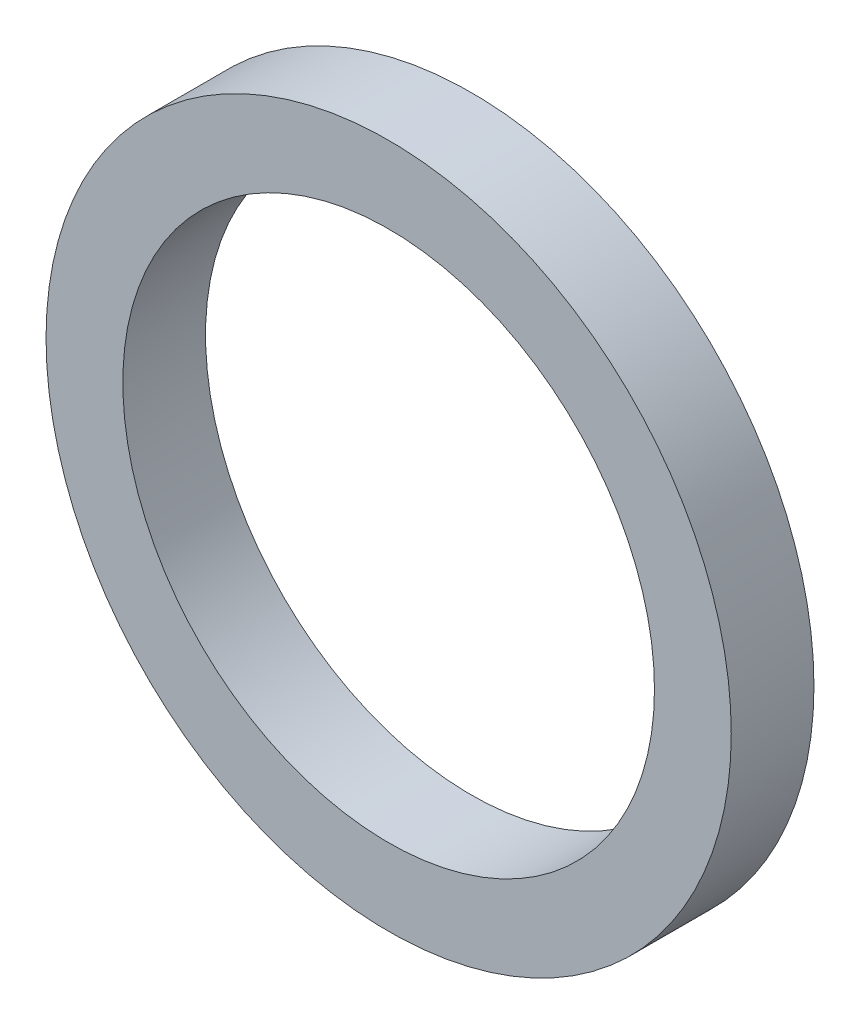
ISO-10303-21;
HEADER;
FILE_DESCRIPTION(('STEP AP214'),'2;1');
FILE_NAME('part.step','',(''),(''),'','','');
FILE_SCHEMA(('AUTOMOTIVE_DESIGN { 1 0 10303 214 1 1 1 1 }'));
ENDSEC;
DATA;
#1=APPLICATION_CONTEXT('core data for automotive mechanical design processes');
#2=APPLICATION_PROTOCOL_DEFINITION('international standard','automotive_design',2000,#1);
#3=PRODUCT_CONTEXT('',#1,'mechanical');
#4=PRODUCT('Part','Part','',(#3));
#5=PRODUCT_RELATED_PRODUCT_CATEGORY('part','',(#4));
#6=PRODUCT_DEFINITION_FORMATION('','',#4);
#7=PRODUCT_DEFINITION_CONTEXT('part definition',#1,'design');
#8=PRODUCT_DEFINITION('design','',#6,#7);
#9=PRODUCT_DEFINITION_SHAPE('','',#8);
#10=(LENGTH_UNIT() NAMED_UNIT(*) SI_UNIT(.MILLI.,.METRE.));
#11=(NAMED_UNIT(*) PLANE_ANGLE_UNIT() SI_UNIT($,.RADIAN.));
#12=(NAMED_UNIT(*) SI_UNIT($,.STERADIAN.) SOLID_ANGLE_UNIT());
#13=UNCERTAINTY_MEASURE_WITH_UNIT(LENGTH_MEASURE(1.E-05),#10,'distance_accuracy_value','');
#14=(GEOMETRIC_REPRESENTATION_CONTEXT(3) GLOBAL_UNCERTAINTY_ASSIGNED_CONTEXT((#13)) GLOBAL_UNIT_ASSIGNED_CONTEXT((#10,
#11,#12)) REPRESENTATION_CONTEXT('',''));
#15=CARTESIAN_POINT('',(0.,0.,0.));
#16=DIRECTION('',(0.,0.,1.));
#17=DIRECTION('',(1.,0.,0.));
#18=AXIS2_PLACEMENT_3D('',#15,#16,#17);
#19=CARTESIAN_POINT('',(0.,0.,3.5));
#20=DIRECTION('',(0.,0.,1.));
#21=DIRECTION('',(1.,0.,0.));
#22=AXIS2_PLACEMENT_3D('',#19,#20,#21);
#23=PLANE('',#22);
#24=CARTESIAN_POINT('',(0.,0.,3.5));
#25=DIRECTION('',(0.,0.,1.));
#26=DIRECTION('',(1.,0.,0.));
#27=AXIS2_PLACEMENT_3D('',#24,#25,#26);
#28=CIRCLE('',#27,29.);
#29=CARTESIAN_POINT('',(29.,0.,3.5));
#30=VERTEX_POINT('',#29);
#31=EDGE_CURVE('E10',#30,#30,#28,.T.);
#32=ORIENTED_EDGE('',*,*,#31,.T.);
#33=EDGE_LOOP('',(#32));
#34=FACE_BOUND('',#33,.T.);
#35=CARTESIAN_POINT('',(0.,0.,3.5));
#36=DIRECTION('',(0.,0.,1.));
#37=DIRECTION('',(1.,0.,0.));
#38=AXIS2_PLACEMENT_3D('',#35,#36,#37);
#39=CIRCLE('',#38,22.5);
#40=CARTESIAN_POINT('',(22.5,0.,3.5));
#41=VERTEX_POINT('',#40);
#42=EDGE_CURVE('E45',#41,#41,#39,.T.);
#43=ORIENTED_EDGE('',*,*,#42,.F.);
#44=EDGE_LOOP('',(#43));
#45=FACE_BOUND('',#44,.T.);
#46=ADVANCED_FACE('F34',(#34,#45),#23,.T.);
#47=CARTESIAN_POINT('',(0.,0.,-3.5));
#48=DIRECTION('',(0.,0.,1.));
#49=DIRECTION('',(1.,0.,0.));
#50=AXIS2_PLACEMENT_3D('',#47,#48,#49);
#51=PLANE('',#50);
#52=CARTESIAN_POINT('',(0.,0.,-3.5));
#53=DIRECTION('',(0.,0.,1.));
#54=DIRECTION('',(1.,0.,0.));
#55=AXIS2_PLACEMENT_3D('',#52,#53,#54);
#56=CIRCLE('',#55,29.);
#57=CARTESIAN_POINT('',(29.,0.,-3.5));
#58=VERTEX_POINT('',#57);
#59=EDGE_CURVE('E38',#58,#58,#56,.T.);
#60=ORIENTED_EDGE('',*,*,#59,.F.);
#61=EDGE_LOOP('',(#60));
#62=FACE_BOUND('',#61,.T.);
#63=CARTESIAN_POINT('',(0.,0.,-3.5));
#64=DIRECTION('',(0.,0.,1.));
#65=DIRECTION('',(1.,0.,0.));
#66=AXIS2_PLACEMENT_3D('',#63,#64,#65);
#67=CIRCLE('',#66,22.5);
#68=CARTESIAN_POINT('',(22.5,0.,-3.5));
#69=VERTEX_POINT('',#68);
#70=EDGE_CURVE('E47',#69,#69,#67,.T.);
#71=ORIENTED_EDGE('',*,*,#70,.T.);
#72=EDGE_LOOP('',(#71));
#73=FACE_BOUND('',#72,.T.);
#74=ADVANCED_FACE('F57',(#62,#73),#51,.F.);
#75=CARTESIAN_POINT('',(0.,0.,3.5));
#76=DIRECTION('',(0.,0.,-1.));
#77=DIRECTION('',(-1.,0.,0.));
#78=AXIS2_PLACEMENT_3D('',#75,#76,#77);
#79=CYLINDRICAL_SURFACE('',#78,29.);
#80=ORIENTED_EDGE('',*,*,#31,.F.);
#81=EDGE_LOOP('',(#80));
#82=FACE_BOUND('',#81,.T.);
#83=ORIENTED_EDGE('',*,*,#59,.T.);
#84=EDGE_LOOP('',(#83));
#85=FACE_BOUND('',#84,.T.);
#86=ADVANCED_FACE('F36',(#82,#85),#79,.T.);
#87=CARTESIAN_POINT('',(0.,0.,3.5));
#88=DIRECTION('',(0.,0.,-1.));
#89=DIRECTION('',(-1.,0.,0.));
#90=AXIS2_PLACEMENT_3D('',#87,#88,#89);
#91=CYLINDRICAL_SURFACE('',#90,22.5);
#92=ORIENTED_EDGE('',*,*,#42,.T.);
#93=EDGE_LOOP('',(#92));
#94=FACE_BOUND('',#93,.T.);
#95=ORIENTED_EDGE('',*,*,#70,.F.);
#96=EDGE_LOOP('',(#95));
#97=FACE_BOUND('',#96,.T.);
#98=ADVANCED_FACE('F53',(#94,#97),#91,.F.);
#99=CLOSED_SHELL('',(#46,#74,#86,#98));
#100=MANIFOLD_SOLID_BREP('B2',#99);
#101=ADVANCED_BREP_SHAPE_REPRESENTATION('',(#18,#100),#14);
#102=SHAPE_DEFINITION_REPRESENTATION(#9,#101);
ENDSEC;
END-ISO-10303-21;
